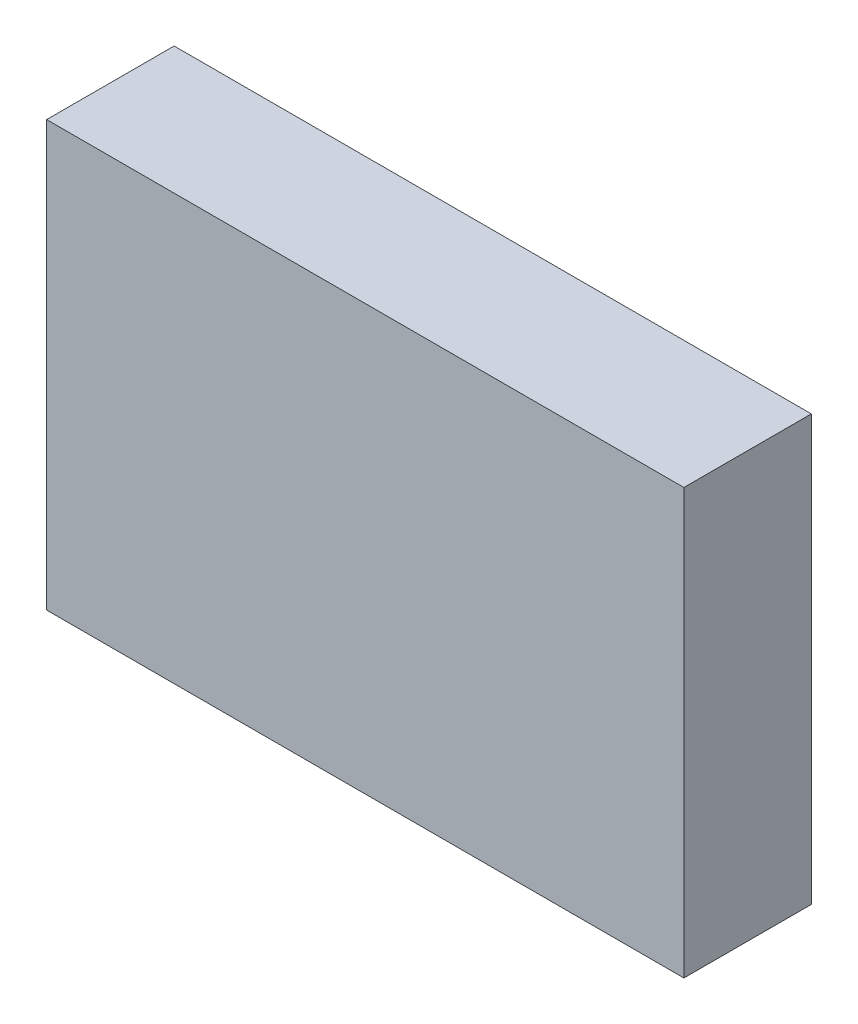
ISO-10303-21;
HEADER;
FILE_DESCRIPTION(('STEP AP214'),'2;1');
FILE_NAME('part.step','',(''),(''),'','','');
FILE_SCHEMA(('AUTOMOTIVE_DESIGN { 1 0 10303 214 1 1 1 1 }'));
ENDSEC;
DATA;
#1=APPLICATION_CONTEXT('core data for automotive mechanical design processes');
#2=APPLICATION_PROTOCOL_DEFINITION('international standard','automotive_design',2000,#1);
#3=PRODUCT_CONTEXT('',#1,'mechanical');
#4=PRODUCT('Part','Part','',(#3));
#5=PRODUCT_RELATED_PRODUCT_CATEGORY('part','',(#4));
#6=PRODUCT_DEFINITION_FORMATION('','',#4);
#7=PRODUCT_DEFINITION_CONTEXT('part definition',#1,'design');
#8=PRODUCT_DEFINITION('design','',#6,#7);
#9=PRODUCT_DEFINITION_SHAPE('','',#8);
#10=(LENGTH_UNIT() NAMED_UNIT(*) SI_UNIT(.MILLI.,.METRE.));
#11=(NAMED_UNIT(*) PLANE_ANGLE_UNIT() SI_UNIT($,.RADIAN.));
#12=(NAMED_UNIT(*) SI_UNIT($,.STERADIAN.) SOLID_ANGLE_UNIT());
#13=UNCERTAINTY_MEASURE_WITH_UNIT(LENGTH_MEASURE(1.E-05),#10,'distance_accuracy_value','');
#14=(GEOMETRIC_REPRESENTATION_CONTEXT(3) GLOBAL_UNCERTAINTY_ASSIGNED_CONTEXT((#13)) GLOBAL_UNIT_ASSIGNED_CONTEXT((#10,
#11,#12)) REPRESENTATION_CONTEXT('',''));
#15=CARTESIAN_POINT('',(0.,0.,0.));
#16=DIRECTION('',(0.,0.,1.));
#17=DIRECTION('',(1.,0.,0.));
#18=AXIS2_PLACEMENT_3D('',#15,#16,#17);
#19=CARTESIAN_POINT('',(30.,20.,12.));
#20=DIRECTION('',(-1.,0.,0.));
#21=DIRECTION('',(0.,0.,1.));
#22=AXIS2_PLACEMENT_3D('',#19,#20,#21);
#23=PLANE('',#22);
#24=DIRECTION('',(0.,1.,0.));
#25=VECTOR('',#24,1.);
#26=CARTESIAN_POINT('',(30.,20.,0.));
#27=LINE('',#26,#25);
#28=CARTESIAN_POINT('',(30.,-20.,0.));
#29=VERTEX_POINT('',#28);
#30=CARTESIAN_POINT('',(30.,20.,0.));
#31=VERTEX_POINT('',#30);
#32=EDGE_CURVE('E94',#29,#31,#27,.T.);
#33=ORIENTED_EDGE('',*,*,#32,.T.);
#34=DIRECTION('',(0.,0.,-1.));
#35=VECTOR('',#34,1.);
#36=CARTESIAN_POINT('',(30.,20.,12.));
#37=LINE('',#36,#35);
#38=CARTESIAN_POINT('',(30.,20.,12.));
#39=VERTEX_POINT('',#38);
#40=EDGE_CURVE('E11',#39,#31,#37,.T.);
#41=ORIENTED_EDGE('',*,*,#40,.F.);
#42=DIRECTION('',(0.,1.,0.));
#43=VECTOR('',#42,1.);
#44=CARTESIAN_POINT('',(30.,20.,12.));
#45=LINE('',#44,#43);
#46=CARTESIAN_POINT('',(30.,-20.,12.));
#47=VERTEX_POINT('',#46);
#48=EDGE_CURVE('E82',#47,#39,#45,.T.);
#49=ORIENTED_EDGE('',*,*,#48,.F.);
#50=DIRECTION('',(0.,0.,-1.));
#51=VECTOR('',#50,1.);
#52=CARTESIAN_POINT('',(30.,-20.,12.));
#53=LINE('',#52,#51);
#54=EDGE_CURVE('E90',#47,#29,#53,.T.);
#55=ORIENTED_EDGE('',*,*,#54,.T.);
#56=EDGE_LOOP('',(#33,#41,#49,#55));
#57=FACE_BOUND('',#56,.T.);
#58=ADVANCED_FACE('F31',(#57),#23,.F.);
#59=CARTESIAN_POINT('',(-30.,20.,12.));
#60=DIRECTION('',(0.,-1.,0.));
#61=DIRECTION('',(0.,0.,-1.));
#62=AXIS2_PLACEMENT_3D('',#59,#60,#61);
#63=PLANE('',#62);
#64=DIRECTION('',(-1.,0.,0.));
#65=VECTOR('',#64,1.);
#66=CARTESIAN_POINT('',(-30.,20.,0.));
#67=LINE('',#66,#65);
#68=CARTESIAN_POINT('',(-30.,20.,0.));
#69=VERTEX_POINT('',#68);
#70=EDGE_CURVE('E86',#31,#69,#67,.T.);
#71=ORIENTED_EDGE('',*,*,#70,.T.);
#72=DIRECTION('',(0.,0.,-1.));
#73=VECTOR('',#72,1.);
#74=CARTESIAN_POINT('',(-30.,20.,12.));
#75=LINE('',#74,#73);
#76=CARTESIAN_POINT('',(-30.,20.,12.));
#77=VERTEX_POINT('',#76);
#78=EDGE_CURVE('E39',#77,#69,#75,.T.);
#79=ORIENTED_EDGE('',*,*,#78,.F.);
#80=DIRECTION('',(-1.,0.,0.));
#81=VECTOR('',#80,1.);
#82=CARTESIAN_POINT('',(-30.,20.,12.));
#83=LINE('',#82,#81);
#84=EDGE_CURVE('E77',#39,#77,#83,.T.);
#85=ORIENTED_EDGE('',*,*,#84,.F.);
#86=ORIENTED_EDGE('',*,*,#40,.T.);
#87=EDGE_LOOP('',(#71,#79,#85,#86));
#88=FACE_BOUND('',#87,.T.);
#89=ADVANCED_FACE('F85',(#88),#63,.F.);
#90=CARTESIAN_POINT('',(-30.,20.,12.));
#91=DIRECTION('',(1.,0.,0.));
#92=DIRECTION('',(0.,0.,-1.));
#93=AXIS2_PLACEMENT_3D('',#90,#91,#92);
#94=PLANE('',#93);
#95=DIRECTION('',(0.,-1.,0.));
#96=VECTOR('',#95,1.);
#97=CARTESIAN_POINT('',(-30.,20.,0.));
#98=LINE('',#97,#96);
#99=CARTESIAN_POINT('',(-30.,-20.,0.));
#100=VERTEX_POINT('',#99);
#101=EDGE_CURVE('E64',#69,#100,#98,.T.);
#102=ORIENTED_EDGE('',*,*,#101,.T.);
#103=DIRECTION('',(0.,0.,-1.));
#104=VECTOR('',#103,1.);
#105=CARTESIAN_POINT('',(-30.,-20.,12.));
#106=LINE('',#105,#104);
#107=CARTESIAN_POINT('',(-30.,-20.,12.));
#108=VERTEX_POINT('',#107);
#109=EDGE_CURVE('E87',#108,#100,#106,.T.);
#110=ORIENTED_EDGE('',*,*,#109,.F.);
#111=DIRECTION('',(0.,-1.,0.));
#112=VECTOR('',#111,1.);
#113=CARTESIAN_POINT('',(-30.,20.,12.));
#114=LINE('',#113,#112);
#115=EDGE_CURVE('E80',#77,#108,#114,.T.);
#116=ORIENTED_EDGE('',*,*,#115,.F.);
#117=ORIENTED_EDGE('',*,*,#78,.T.);
#118=EDGE_LOOP('',(#102,#110,#116,#117));
#119=FACE_BOUND('',#118,.T.);
#120=ADVANCED_FACE('F88',(#119),#94,.F.);
#121=CARTESIAN_POINT('',(-30.,-20.,12.));
#122=DIRECTION('',(0.,1.,0.));
#123=DIRECTION('',(0.,0.,1.));
#124=AXIS2_PLACEMENT_3D('',#121,#122,#123);
#125=PLANE('',#124);
#126=DIRECTION('',(1.,0.,0.));
#127=VECTOR('',#126,1.);
#128=CARTESIAN_POINT('',(-30.,-20.,0.));
#129=LINE('',#128,#127);
#130=EDGE_CURVE('E70',#100,#29,#129,.T.);
#131=ORIENTED_EDGE('',*,*,#130,.T.);
#132=ORIENTED_EDGE('',*,*,#54,.F.);
#133=DIRECTION('',(1.,0.,0.));
#134=VECTOR('',#133,1.);
#135=CARTESIAN_POINT('',(-30.,-20.,12.));
#136=LINE('',#135,#134);
#137=EDGE_CURVE('E47',#108,#47,#136,.T.);
#138=ORIENTED_EDGE('',*,*,#137,.F.);
#139=ORIENTED_EDGE('',*,*,#109,.T.);
#140=EDGE_LOOP('',(#131,#132,#138,#139));
#141=FACE_BOUND('',#140,.T.);
#142=ADVANCED_FACE('F102',(#141),#125,.F.);
#143=CARTESIAN_POINT('',(30.,-20.,12.));
#144=DIRECTION('',(0.,0.,1.));
#145=DIRECTION('',(1.,0.,0.));
#146=AXIS2_PLACEMENT_3D('',#143,#144,#145);
#147=PLANE('',#146);
#148=ORIENTED_EDGE('',*,*,#48,.T.);
#149=ORIENTED_EDGE('',*,*,#84,.T.);
#150=ORIENTED_EDGE('',*,*,#115,.T.);
#151=ORIENTED_EDGE('',*,*,#137,.T.);
#152=EDGE_LOOP('',(#148,#149,#150,#151));
#153=FACE_BOUND('',#152,.T.);
#154=ADVANCED_FACE('F78',(#153),#147,.T.);
#155=CARTESIAN_POINT('',(30.,-20.,0.));
#156=DIRECTION('',(0.,0.,1.));
#157=DIRECTION('',(1.,0.,0.));
#158=AXIS2_PLACEMENT_3D('',#155,#156,#157);
#159=PLANE('',#158);
#160=CARTESIAN_POINT('',(0.,0.,0.));
#161=DIRECTION('',(0.,0.,-1.));
#162=DIRECTION('',(-1.,0.,0.));
#163=AXIS2_PLACEMENT_3D('',#160,#161,#162);
#164=CIRCLE('',#163,10.);
#165=CARTESIAN_POINT('',(-10.,0.,0.));
#166=VERTEX_POINT('',#165);
#167=EDGE_CURVE('E108',#166,#166,#164,.T.);
#168=ORIENTED_EDGE('',*,*,#167,.F.);
#169=EDGE_LOOP('',(#168));
#170=FACE_BOUND('',#169,.T.);
#171=ORIENTED_EDGE('',*,*,#32,.F.);
#172=ORIENTED_EDGE('',*,*,#130,.F.);
#173=ORIENTED_EDGE('',*,*,#101,.F.);
#174=ORIENTED_EDGE('',*,*,#70,.F.);
#175=EDGE_LOOP('',(#171,#172,#173,#174));
#176=FACE_BOUND('',#175,.T.);
#177=ADVANCED_FACE('F105',(#170,#176),#159,.F.);
#178=CARTESIAN_POINT('',(0.,0.,3.));
#179=DIRECTION('',(0.,0.,-1.));
#180=DIRECTION('',(-1.,0.,0.));
#181=AXIS2_PLACEMENT_3D('',#178,#179,#180);
#182=CYLINDRICAL_SURFACE('',#181,10.);
#183=CARTESIAN_POINT('',(0.,0.,3.));
#184=DIRECTION('',(0.,0.,-1.));
#185=DIRECTION('',(-1.,0.,0.));
#186=AXIS2_PLACEMENT_3D('',#183,#184,#185);
#187=CIRCLE('',#186,10.);
#188=CARTESIAN_POINT('',(-10.,0.,3.));
#189=VERTEX_POINT('',#188);
#190=EDGE_CURVE('E97',#189,#189,#187,.T.);
#191=ORIENTED_EDGE('',*,*,#190,.F.);
#192=EDGE_LOOP('',(#191));
#193=FACE_BOUND('',#192,.T.);
#194=ORIENTED_EDGE('',*,*,#167,.T.);
#195=EDGE_LOOP('',(#194));
#196=FACE_BOUND('',#195,.T.);
#197=ADVANCED_FACE('F116',(#193,#196),#182,.F.);
#198=CARTESIAN_POINT('',(0.,0.,3.));
#199=DIRECTION('',(0.,0.,-1.));
#200=DIRECTION('',(-1.,0.,0.));
#201=AXIS2_PLACEMENT_3D('',#198,#199,#200);
#202=PLANE('',#201);
#203=ORIENTED_EDGE('',*,*,#190,.T.);
#204=EDGE_LOOP('',(#203));
#205=FACE_BOUND('',#204,.T.);
#206=ADVANCED_FACE('F114',(#205),#202,.T.);
#207=CLOSED_SHELL('',(#58,#89,#120,#142,#154,#177,#197,#206));
#208=MANIFOLD_SOLID_BREP('B2',#207);
#209=ADVANCED_BREP_SHAPE_REPRESENTATION('',(#18,#208),#14);
#210=SHAPE_DEFINITION_REPRESENTATION(#9,#209);
ENDSEC;
END-ISO-10303-21;
